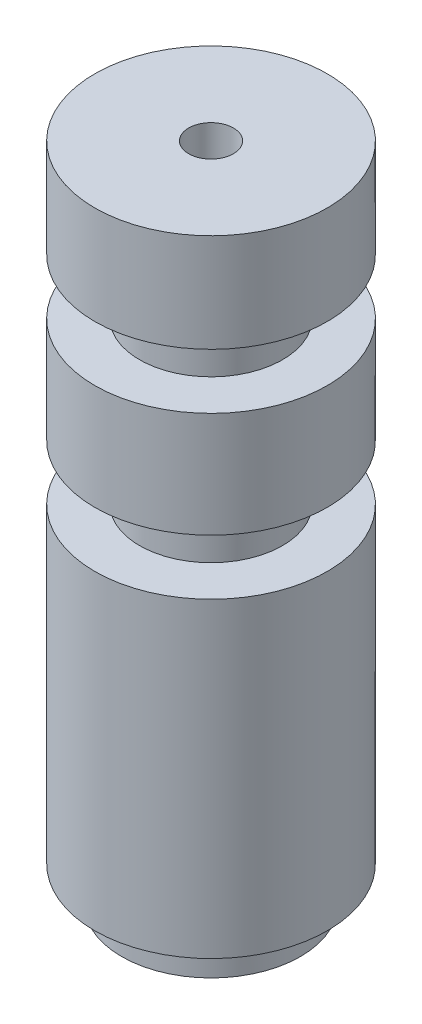
ISO-10303-21;
HEADER;
FILE_DESCRIPTION(('STEP AP214'),'2;1');
FILE_NAME('part.step','',(''),(''),'','','');
FILE_SCHEMA(('AUTOMOTIVE_DESIGN { 1 0 10303 214 1 1 1 1 }'));
ENDSEC;
DATA;
#1=APPLICATION_CONTEXT('core data for automotive mechanical design processes');
#2=APPLICATION_PROTOCOL_DEFINITION('international standard','automotive_design',2000,#1);
#3=PRODUCT_CONTEXT('',#1,'mechanical');
#4=PRODUCT('Part','Part','',(#3));
#5=PRODUCT_RELATED_PRODUCT_CATEGORY('part','',(#4));
#6=PRODUCT_DEFINITION_FORMATION('','',#4);
#7=PRODUCT_DEFINITION_CONTEXT('part definition',#1,'design');
#8=PRODUCT_DEFINITION('design','',#6,#7);
#9=PRODUCT_DEFINITION_SHAPE('','',#8);
#10=(LENGTH_UNIT() NAMED_UNIT(*) SI_UNIT(.MILLI.,.METRE.));
#11=(NAMED_UNIT(*) PLANE_ANGLE_UNIT() SI_UNIT($,.RADIAN.));
#12=(NAMED_UNIT(*) SI_UNIT($,.STERADIAN.) SOLID_ANGLE_UNIT());
#13=UNCERTAINTY_MEASURE_WITH_UNIT(LENGTH_MEASURE(1.E-05),#10,'distance_accuracy_value','');
#14=(GEOMETRIC_REPRESENTATION_CONTEXT(3) GLOBAL_UNCERTAINTY_ASSIGNED_CONTEXT((#13)) GLOBAL_UNIT_ASSIGNED_CONTEXT((#10,
#11,#12)) REPRESENTATION_CONTEXT('',''));
#15=CARTESIAN_POINT('',(0.,0.,0.));
#16=DIRECTION('',(0.,0.,1.));
#17=DIRECTION('',(1.,0.,0.));
#18=AXIS2_PLACEMENT_3D('',#15,#16,#17);
#19=CARTESIAN_POINT('',(0.,0.,0.));
#20=DIRECTION('',(0.,1.,0.));
#21=DIRECTION('',(0.,0.,1.));
#22=AXIS2_PLACEMENT_3D('',#19,#20,#21);
#23=PLANE('',#22);
#24=CARTESIAN_POINT('',(0.,0.,0.));
#25=DIRECTION('',(0.,1.,0.));
#26=DIRECTION('',(0.,0.,1.));
#27=AXIS2_PLACEMENT_3D('',#24,#25,#26);
#28=CIRCLE('',#27,6.5);
#29=CARTESIAN_POINT('',(0.,0.,6.5));
#30=VERTEX_POINT('',#29);
#31=EDGE_CURVE('E47',#30,#30,#28,.T.);
#32=ORIENTED_EDGE('',*,*,#31,.F.);
#33=EDGE_LOOP('',(#32));
#34=FACE_BOUND('',#33,.T.);
#35=CARTESIAN_POINT('',(0.,0.,0.));
#36=DIRECTION('',(0.,1.,0.));
#37=DIRECTION('',(0.,0.,1.));
#38=AXIS2_PLACEMENT_3D('',#35,#36,#37);
#39=CIRCLE('',#38,5.);
#40=CARTESIAN_POINT('',(0.,0.,5.));
#41=VERTEX_POINT('',#40);
#42=EDGE_CURVE('E11',#41,#41,#39,.F.);
#43=ORIENTED_EDGE('',*,*,#42,.F.);
#44=EDGE_LOOP('',(#43));
#45=FACE_BOUND('',#44,.T.);
#46=ADVANCED_FACE('F36',(#34,#45),#23,.F.);
#47=CARTESIAN_POINT('',(0.,35.,0.));
#48=DIRECTION('',(0.,-1.,0.));
#49=DIRECTION('',(0.,0.,-1.));
#50=AXIS2_PLACEMENT_3D('',#47,#48,#49);
#51=CYLINDRICAL_SURFACE('',#50,6.5);
#52=CARTESIAN_POINT('',(0.,20.5,0.));
#53=DIRECTION('',(0.,1.,0.));
#54=DIRECTION('',(0.,0.,1.));
#55=AXIS2_PLACEMENT_3D('',#52,#53,#54);
#56=CIRCLE('',#55,6.5);
#57=CARTESIAN_POINT('',(0.,20.5,6.5));
#58=VERTEX_POINT('',#57);
#59=EDGE_CURVE('E60',#58,#58,#56,.T.);
#60=ORIENTED_EDGE('',*,*,#59,.T.);
#61=EDGE_LOOP('',(#60));
#62=FACE_BOUND('',#61,.T.);
#63=CARTESIAN_POINT('',(0.,26.4,0.));
#64=DIRECTION('',(0.,1.,0.));
#65=DIRECTION('',(0.,0.,1.));
#66=AXIS2_PLACEMENT_3D('',#63,#64,#65);
#67=CIRCLE('',#66,6.5);
#68=CARTESIAN_POINT('',(0.,26.4,6.5));
#69=VERTEX_POINT('',#68);
#70=EDGE_CURVE('E64',#69,#69,#67,.T.);
#71=ORIENTED_EDGE('',*,*,#70,.F.);
#72=EDGE_LOOP('',(#71));
#73=FACE_BOUND('',#72,.T.);
#74=ADVANCED_FACE('F109',(#62,#73),#51,.T.);
#75=ORIENTED_EDGE('',*,*,#31,.T.);
#76=EDGE_LOOP('',(#75));
#77=FACE_BOUND('',#76,.T.);
#78=CARTESIAN_POINT('',(0.,17.4,0.));
#79=DIRECTION('',(0.,1.,0.));
#80=DIRECTION('',(0.,0.,1.));
#81=AXIS2_PLACEMENT_3D('',#78,#79,#80);
#82=CIRCLE('',#81,6.5);
#83=CARTESIAN_POINT('',(0.,17.4,6.5));
#84=VERTEX_POINT('',#83);
#85=EDGE_CURVE('E57',#84,#84,#82,.T.);
#86=ORIENTED_EDGE('',*,*,#85,.F.);
#87=EDGE_LOOP('',(#86));
#88=FACE_BOUND('',#87,.T.);
#89=ADVANCED_FACE('F114',(#77,#88),#51,.T.);
#90=CARTESIAN_POINT('',(0.,29.5,0.));
#91=DIRECTION('',(0.,1.,0.));
#92=DIRECTION('',(0.,0.,1.));
#93=AXIS2_PLACEMENT_3D('',#90,#91,#92);
#94=CIRCLE('',#93,6.5);
#95=CARTESIAN_POINT('',(0.,29.5,6.5));
#96=VERTEX_POINT('',#95);
#97=EDGE_CURVE('E66',#96,#96,#94,.T.);
#98=ORIENTED_EDGE('',*,*,#97,.T.);
#99=EDGE_LOOP('',(#98));
#100=FACE_BOUND('',#99,.T.);
#101=CARTESIAN_POINT('',(0.,35.,0.));
#102=DIRECTION('',(0.,1.,0.));
#103=DIRECTION('',(0.,0.,1.));
#104=AXIS2_PLACEMENT_3D('',#101,#102,#103);
#105=CIRCLE('',#104,6.5);
#106=CARTESIAN_POINT('',(0.,35.,6.5));
#107=VERTEX_POINT('',#106);
#108=EDGE_CURVE('E43',#107,#107,#105,.T.);
#109=ORIENTED_EDGE('',*,*,#108,.F.);
#110=EDGE_LOOP('',(#109));
#111=FACE_BOUND('',#110,.T.);
#112=ADVANCED_FACE('F38',(#100,#111),#51,.T.);
#113=CARTESIAN_POINT('',(0.,35.,0.));
#114=DIRECTION('',(0.,1.,0.));
#115=DIRECTION('',(0.,0.,1.));
#116=AXIS2_PLACEMENT_3D('',#113,#114,#115);
#117=PLANE('',#116);
#118=CARTESIAN_POINT('',(0.,35.,0.));
#119=DIRECTION('',(0.,-1.,0.));
#120=DIRECTION('',(0.,0.,-1.));
#121=AXIS2_PLACEMENT_3D('',#118,#119,#120);
#122=CIRCLE('',#121,1.25);
#123=CARTESIAN_POINT('',(0.,35.,-1.25));
#124=VERTEX_POINT('',#123);
#125=EDGE_CURVE('E52',#124,#124,#122,.T.);
#126=ORIENTED_EDGE('',*,*,#125,.T.);
#127=EDGE_LOOP('',(#126));
#128=FACE_BOUND('',#127,.T.);
#129=ORIENTED_EDGE('',*,*,#108,.T.);
#130=EDGE_LOOP('',(#129));
#131=FACE_BOUND('',#130,.T.);
#132=ADVANCED_FACE('F119',(#128,#131),#117,.T.);
#133=CARTESIAN_POINT('',(0.,35.,0.));
#134=DIRECTION('',(0.,-1.,0.));
#135=DIRECTION('',(0.,0.,-1.));
#136=AXIS2_PLACEMENT_3D('',#133,#134,#135);
#137=CYLINDRICAL_SURFACE('',#136,1.25);
#138=ORIENTED_EDGE('',*,*,#125,.F.);
#139=EDGE_LOOP('',(#138));
#140=FACE_BOUND('',#139,.T.);
#141=CARTESIAN_POINT('',(0.,-2.,0.));
#142=DIRECTION('',(0.,-1.,0.));
#143=DIRECTION('',(0.,0.,-1.));
#144=AXIS2_PLACEMENT_3D('',#141,#142,#143);
#145=CIRCLE('',#144,1.25);
#146=CARTESIAN_POINT('',(0.,-2.,-1.25));
#147=VERTEX_POINT('',#146);
#148=EDGE_CURVE('E86',#147,#147,#145,.T.);
#149=ORIENTED_EDGE('',*,*,#148,.T.);
#150=EDGE_LOOP('',(#149));
#151=FACE_BOUND('',#150,.T.);
#152=ADVANCED_FACE('F90',(#140,#151),#137,.F.);
#153=CARTESIAN_POINT('',(0.,20.5,0.));
#154=DIRECTION('',(0.,1.,0.));
#155=DIRECTION('',(0.,0.,1.));
#156=AXIS2_PLACEMENT_3D('',#153,#154,#155);
#157=PLANE('',#156);
#158=CARTESIAN_POINT('',(0.,20.5,0.));
#159=DIRECTION('',(0.,-1.,0.));
#160=DIRECTION('',(0.,0.,-1.));
#161=AXIS2_PLACEMENT_3D('',#158,#159,#160);
#162=CIRCLE('',#161,4.);
#163=CARTESIAN_POINT('',(0.,20.5,-4.));
#164=VERTEX_POINT('',#163);
#165=EDGE_CURVE('E69',#164,#164,#162,.T.);
#166=ORIENTED_EDGE('',*,*,#165,.F.);
#167=EDGE_LOOP('',(#166));
#168=FACE_BOUND('',#167,.T.);
#169=ORIENTED_EDGE('',*,*,#59,.F.);
#170=EDGE_LOOP('',(#169));
#171=FACE_BOUND('',#170,.T.);
#172=ADVANCED_FACE('F125',(#168,#171),#157,.F.);
#173=CARTESIAN_POINT('',(0.,17.4,0.));
#174=DIRECTION('',(0.,1.,0.));
#175=DIRECTION('',(0.,0.,1.));
#176=AXIS2_PLACEMENT_3D('',#173,#174,#175);
#177=PLANE('',#176);
#178=CARTESIAN_POINT('',(0.,17.4,0.));
#179=DIRECTION('',(0.,-1.,0.));
#180=DIRECTION('',(0.,0.,-1.));
#181=AXIS2_PLACEMENT_3D('',#178,#179,#180);
#182=CIRCLE('',#181,4.);
#183=CARTESIAN_POINT('',(0.,17.4,-4.));
#184=VERTEX_POINT('',#183);
#185=EDGE_CURVE('E61',#184,#184,#182,.T.);
#186=ORIENTED_EDGE('',*,*,#185,.T.);
#187=EDGE_LOOP('',(#186));
#188=FACE_BOUND('',#187,.T.);
#189=ORIENTED_EDGE('',*,*,#85,.T.);
#190=EDGE_LOOP('',(#189));
#191=FACE_BOUND('',#190,.T.);
#192=ADVANCED_FACE('F129',(#188,#191),#177,.T.);
#193=CARTESIAN_POINT('',(0.,20.5,0.));
#194=DIRECTION('',(0.,-1.,0.));
#195=DIRECTION('',(0.,0.,-1.));
#196=AXIS2_PLACEMENT_3D('',#193,#194,#195);
#197=CYLINDRICAL_SURFACE('',#196,4.);
#198=CARTESIAN_POINT('',(0.,20.5,-4.));
#199=CARTESIAN_POINT('',(0.,20.4677083333333,-4.));
#200=CARTESIAN_POINT('',(0.,20.4354166666667,-4.));
#201=CARTESIAN_POINT('',(0.,20.3708333333333,-4.));
#202=CARTESIAN_POINT('',(0.,20.3385416666667,-4.));
#203=CARTESIAN_POINT('',(0.,20.2739583333333,-4.));
#204=CARTESIAN_POINT('',(0.,20.2416666666667,-4.));
#205=CARTESIAN_POINT('',(0.,20.1770833333333,-4.));
#206=CARTESIAN_POINT('',(0.,20.1447916666667,-4.));
#207=CARTESIAN_POINT('',(0.,20.0802083333333,-4.));
#208=CARTESIAN_POINT('',(0.,20.0479166666667,-4.));
#209=CARTESIAN_POINT('',(0.,19.9833333333333,-4.));
#210=CARTESIAN_POINT('',(0.,19.9510416666667,-4.));
#211=CARTESIAN_POINT('',(0.,19.8864583333333,-4.));
#212=CARTESIAN_POINT('',(0.,19.8541666666667,-4.));
#213=CARTESIAN_POINT('',(0.,19.7895833333333,-4.));
#214=CARTESIAN_POINT('',(0.,19.7572916666667,-4.));
#215=CARTESIAN_POINT('',(0.,19.6927083333333,-4.));
#216=CARTESIAN_POINT('',(0.,19.6604166666667,-4.));
#217=CARTESIAN_POINT('',(0.,19.5958333333333,-4.));
#218=CARTESIAN_POINT('',(0.,19.5635416666667,-4.));
#219=CARTESIAN_POINT('',(0.,19.4989583333333,-4.));
#220=CARTESIAN_POINT('',(0.,19.4666666666667,-4.));
#221=CARTESIAN_POINT('',(0.,19.4020833333333,-4.));
#222=CARTESIAN_POINT('',(0.,19.3697916666667,-4.));
#223=CARTESIAN_POINT('',(0.,19.3052083333333,-4.));
#224=CARTESIAN_POINT('',(0.,19.2729166666667,-4.));
#225=CARTESIAN_POINT('',(0.,19.2083333333333,-4.));
#226=CARTESIAN_POINT('',(0.,19.1760416666667,-4.));
#227=CARTESIAN_POINT('',(0.,19.1114583333333,-4.));
#228=CARTESIAN_POINT('',(0.,19.0791666666667,-4.));
#229=CARTESIAN_POINT('',(0.,19.0145833333333,-4.));
#230=CARTESIAN_POINT('',(0.,18.9822916666667,-4.));
#231=CARTESIAN_POINT('',(0.,18.9177083333333,-4.));
#232=CARTESIAN_POINT('',(0.,18.8854166666667,-4.));
#233=CARTESIAN_POINT('',(0.,18.8208333333333,-4.));
#234=CARTESIAN_POINT('',(0.,18.7885416666667,-4.));
#235=CARTESIAN_POINT('',(0.,18.7239583333333,-4.));
#236=CARTESIAN_POINT('',(0.,18.6916666666667,-4.));
#237=CARTESIAN_POINT('',(0.,18.6270833333333,-4.));
#238=CARTESIAN_POINT('',(0.,18.5947916666667,-4.));
#239=CARTESIAN_POINT('',(0.,18.5302083333333,-4.));
#240=CARTESIAN_POINT('',(0.,18.4979166666667,-4.));
#241=CARTESIAN_POINT('',(0.,18.4333333333333,-4.));
#242=CARTESIAN_POINT('',(0.,18.4010416666667,-4.));
#243=CARTESIAN_POINT('',(0.,18.3364583333333,-4.));
#244=CARTESIAN_POINT('',(0.,18.3041666666667,-4.));
#245=CARTESIAN_POINT('',(0.,18.2395833333333,-4.));
#246=CARTESIAN_POINT('',(0.,18.2072916666667,-4.));
#247=CARTESIAN_POINT('',(0.,18.1427083333333,-4.));
#248=CARTESIAN_POINT('',(0.,18.1104166666667,-4.));
#249=CARTESIAN_POINT('',(0.,18.0458333333333,-4.));
#250=CARTESIAN_POINT('',(0.,18.0135416666667,-4.));
#251=CARTESIAN_POINT('',(0.,17.9489583333333,-4.));
#252=CARTESIAN_POINT('',(0.,17.9166666666667,-4.));
#253=CARTESIAN_POINT('',(0.,17.8520833333333,-4.));
#254=CARTESIAN_POINT('',(0.,17.8197916666667,-4.));
#255=CARTESIAN_POINT('',(0.,17.7552083333333,-4.));
#256=CARTESIAN_POINT('',(0.,17.7229166666667,-4.));
#257=CARTESIAN_POINT('',(0.,17.6583333333333,-4.));
#258=CARTESIAN_POINT('',(0.,17.6260416666667,-4.));
#259=CARTESIAN_POINT('',(0.,17.5614583333333,-4.));
#260=CARTESIAN_POINT('',(0.,17.5291666666667,-4.));
#261=CARTESIAN_POINT('',(0.,17.4645833333333,-4.));
#262=CARTESIAN_POINT('',(0.,17.4322916666667,-4.));
#263=CARTESIAN_POINT('',(0.,17.4,-4.));
#264=B_SPLINE_CURVE_WITH_KNOTS('',3,(#198,#199,#200,#201,#202,#203,#204,#205,#206,#207,#208,
#209,#210,#211,#212,#213,#214,#215,#216,#217,#218,#219,#220,#221,#222,#223,#224,#225,#226,#227,
#228,#229,#230,#231,#232,#233,#234,#235,#236,#237,#238,#239,#240,#241,#242,#243,#244,#245,#246,
#247,#248,#249,#250,#251,#252,#253,#254,#255,#256,#257,#258,#259,#260,#261,#262,#263),
.UNSPECIFIED.,.F.,.F.,(4,2,2,2,2,2,2,2,2,2,2,2,2,2,2,2,2,2,2,2,2,2,2,2,2,2,2,2,2,2,2,2,4),(0.,
0.0968750000000032,0.193750000000003,0.290625000000003,0.387500000000002,0.484375000000002,
0.581250000000002,0.678125000000002,0.775000000000001,0.871875000000001,0.968750000000001,
1.065625,1.1625,1.259375,1.35625,1.453125,1.55,1.646875,1.74375,1.840625,1.9375,2.034375,
2.13125,2.228125,2.325,2.421875,2.51875,2.615625,2.7125,2.809375,2.90625,3.003125,3.1),.UNSPECIFIED.);
#265=EDGE_CURVE('BSEAM133',#164,#184,#264,.T.);
#266=ORIENTED_EDGE('',*,*,#165,.T.);
#267=ORIENTED_EDGE('',*,*,#185,.F.);
#268=ORIENTED_EDGE('',*,*,#265,.T.);
#269=ORIENTED_EDGE('',*,*,#265,.F.);
#270=EDGE_LOOP('',(#266,#268,#267,#269));
#271=FACE_BOUND('',#270,.T.);
#272=ADVANCED_FACE('F133',(#271),#197,.T.);
#273=CARTESIAN_POINT('',(0.,29.5,0.));
#274=DIRECTION('',(0.,1.,0.));
#275=DIRECTION('',(0.,0.,1.));
#276=AXIS2_PLACEMENT_3D('',#273,#274,#275);
#277=PLANE('',#276);
#278=CARTESIAN_POINT('',(0.,29.5,0.));
#279=DIRECTION('',(0.,-1.,0.));
#280=DIRECTION('',(0.,0.,-1.));
#281=AXIS2_PLACEMENT_3D('',#278,#279,#280);
#282=CIRCLE('',#281,4.);
#283=CARTESIAN_POINT('',(0.,29.5,-4.));
#284=VERTEX_POINT('',#283);
#285=EDGE_CURVE('E80',#284,#284,#282,.T.);
#286=ORIENTED_EDGE('',*,*,#285,.F.);
#287=EDGE_LOOP('',(#286));
#288=FACE_BOUND('',#287,.T.);
#289=ORIENTED_EDGE('',*,*,#97,.F.);
#290=EDGE_LOOP('',(#289));
#291=FACE_BOUND('',#290,.T.);
#292=ADVANCED_FACE('F137',(#288,#291),#277,.F.);
#293=CARTESIAN_POINT('',(0.,26.4,0.));
#294=DIRECTION('',(0.,1.,0.));
#295=DIRECTION('',(0.,0.,1.));
#296=AXIS2_PLACEMENT_3D('',#293,#294,#295);
#297=PLANE('',#296);
#298=CARTESIAN_POINT('',(0.,26.4,0.));
#299=DIRECTION('',(0.,-1.,0.));
#300=DIRECTION('',(0.,0.,-1.));
#301=AXIS2_PLACEMENT_3D('',#298,#299,#300);
#302=CIRCLE('',#301,4.);
#303=CARTESIAN_POINT('',(0.,26.4,-4.));
#304=VERTEX_POINT('',#303);
#305=EDGE_CURVE('E67',#304,#304,#302,.T.);
#306=ORIENTED_EDGE('',*,*,#305,.T.);
#307=EDGE_LOOP('',(#306));
#308=FACE_BOUND('',#307,.T.);
#309=ORIENTED_EDGE('',*,*,#70,.T.);
#310=EDGE_LOOP('',(#309));
#311=FACE_BOUND('',#310,.T.);
#312=ADVANCED_FACE('F105',(#308,#311),#297,.T.);
#313=CARTESIAN_POINT('',(0.,29.5,0.));
#314=DIRECTION('',(0.,-1.,0.));
#315=DIRECTION('',(0.,0.,-1.));
#316=AXIS2_PLACEMENT_3D('',#313,#314,#315);
#317=CYLINDRICAL_SURFACE('',#316,4.);
#318=CARTESIAN_POINT('',(0.,29.5,-4.));
#319=CARTESIAN_POINT('',(0.,29.4677083333333,-4.));
#320=CARTESIAN_POINT('',(0.,29.4354166666667,-4.));
#321=CARTESIAN_POINT('',(0.,29.3708333333333,-4.));
#322=CARTESIAN_POINT('',(0.,29.3385416666667,-4.));
#323=CARTESIAN_POINT('',(0.,29.2739583333333,-4.));
#324=CARTESIAN_POINT('',(0.,29.2416666666667,-4.));
#325=CARTESIAN_POINT('',(0.,29.1770833333333,-4.));
#326=CARTESIAN_POINT('',(0.,29.1447916666667,-4.));
#327=CARTESIAN_POINT('',(0.,29.0802083333333,-4.));
#328=CARTESIAN_POINT('',(0.,29.0479166666667,-4.));
#329=CARTESIAN_POINT('',(0.,28.9833333333333,-4.));
#330=CARTESIAN_POINT('',(0.,28.9510416666667,-4.));
#331=CARTESIAN_POINT('',(0.,28.8864583333333,-4.));
#332=CARTESIAN_POINT('',(0.,28.8541666666667,-4.));
#333=CARTESIAN_POINT('',(0.,28.7895833333333,-4.));
#334=CARTESIAN_POINT('',(0.,28.7572916666667,-4.));
#335=CARTESIAN_POINT('',(0.,28.6927083333333,-4.));
#336=CARTESIAN_POINT('',(0.,28.6604166666667,-4.));
#337=CARTESIAN_POINT('',(0.,28.5958333333333,-4.));
#338=CARTESIAN_POINT('',(0.,28.5635416666667,-4.));
#339=CARTESIAN_POINT('',(0.,28.4989583333333,-4.));
#340=CARTESIAN_POINT('',(0.,28.4666666666667,-4.));
#341=CARTESIAN_POINT('',(0.,28.4020833333333,-4.));
#342=CARTESIAN_POINT('',(0.,28.3697916666667,-4.));
#343=CARTESIAN_POINT('',(0.,28.3052083333333,-4.));
#344=CARTESIAN_POINT('',(0.,28.2729166666667,-4.));
#345=CARTESIAN_POINT('',(0.,28.2083333333333,-4.));
#346=CARTESIAN_POINT('',(0.,28.1760416666667,-4.));
#347=CARTESIAN_POINT('',(0.,28.1114583333333,-4.));
#348=CARTESIAN_POINT('',(0.,28.0791666666667,-4.));
#349=CARTESIAN_POINT('',(0.,28.0145833333333,-4.));
#350=CARTESIAN_POINT('',(0.,27.9822916666667,-4.));
#351=CARTESIAN_POINT('',(0.,27.9177083333333,-4.));
#352=CARTESIAN_POINT('',(0.,27.8854166666667,-4.));
#353=CARTESIAN_POINT('',(0.,27.8208333333333,-4.));
#354=CARTESIAN_POINT('',(0.,27.7885416666667,-4.));
#355=CARTESIAN_POINT('',(0.,27.7239583333333,-4.));
#356=CARTESIAN_POINT('',(0.,27.6916666666667,-4.));
#357=CARTESIAN_POINT('',(0.,27.6270833333333,-4.));
#358=CARTESIAN_POINT('',(0.,27.5947916666667,-4.));
#359=CARTESIAN_POINT('',(0.,27.5302083333333,-4.));
#360=CARTESIAN_POINT('',(0.,27.4979166666667,-4.));
#361=CARTESIAN_POINT('',(0.,27.4333333333333,-4.));
#362=CARTESIAN_POINT('',(0.,27.4010416666667,-4.));
#363=CARTESIAN_POINT('',(0.,27.3364583333333,-4.));
#364=CARTESIAN_POINT('',(0.,27.3041666666667,-4.));
#365=CARTESIAN_POINT('',(0.,27.2395833333333,-4.));
#366=CARTESIAN_POINT('',(0.,27.2072916666667,-4.));
#367=CARTESIAN_POINT('',(0.,27.1427083333333,-4.));
#368=CARTESIAN_POINT('',(0.,27.1104166666667,-4.));
#369=CARTESIAN_POINT('',(0.,27.0458333333333,-4.));
#370=CARTESIAN_POINT('',(0.,27.0135416666667,-4.));
#371=CARTESIAN_POINT('',(0.,26.9489583333333,-4.));
#372=CARTESIAN_POINT('',(0.,26.9166666666667,-4.));
#373=CARTESIAN_POINT('',(0.,26.8520833333333,-4.));
#374=CARTESIAN_POINT('',(0.,26.8197916666667,-4.));
#375=CARTESIAN_POINT('',(0.,26.7552083333333,-4.));
#376=CARTESIAN_POINT('',(0.,26.7229166666667,-4.));
#377=CARTESIAN_POINT('',(0.,26.6583333333333,-4.));
#378=CARTESIAN_POINT('',(0.,26.6260416666667,-4.));
#379=CARTESIAN_POINT('',(0.,26.5614583333333,-4.));
#380=CARTESIAN_POINT('',(0.,26.5291666666667,-4.));
#381=CARTESIAN_POINT('',(0.,26.4645833333333,-4.));
#382=CARTESIAN_POINT('',(0.,26.4322916666667,-4.));
#383=CARTESIAN_POINT('',(0.,26.4,-4.));
#384=B_SPLINE_CURVE_WITH_KNOTS('',3,(#318,#319,#320,#321,#322,#323,#324,#325,#326,#327,#328,
#329,#330,#331,#332,#333,#334,#335,#336,#337,#338,#339,#340,#341,#342,#343,#344,#345,#346,#347,
#348,#349,#350,#351,#352,#353,#354,#355,#356,#357,#358,#359,#360,#361,#362,#363,#364,#365,#366,
#367,#368,#369,#370,#371,#372,#373,#374,#375,#376,#377,#378,#379,#380,#381,#382,#383),
.UNSPECIFIED.,.F.,.F.,(4,2,2,2,2,2,2,2,2,2,2,2,2,2,2,2,2,2,2,2,2,2,2,2,2,2,2,2,2,2,2,2,4),(0.,
0.0968750000000032,0.193750000000003,0.290625000000003,0.387500000000002,0.484375000000002,
0.581250000000002,0.678125000000002,0.775000000000001,0.871875000000001,0.968750000000001,
1.065625,1.1625,1.259375,1.35625,1.453125,1.55,1.646875,1.74375,1.840625,1.9375,2.034375,
2.13125,2.228125,2.325,2.421875,2.51875,2.615625,2.7125,2.809375,2.90625,3.003125,3.1),.UNSPECIFIED.);
#385=EDGE_CURVE('BSEAM100',#284,#304,#384,.T.);
#386=ORIENTED_EDGE('',*,*,#285,.T.);
#387=ORIENTED_EDGE('',*,*,#305,.F.);
#388=ORIENTED_EDGE('',*,*,#385,.T.);
#389=ORIENTED_EDGE('',*,*,#385,.F.);
#390=EDGE_LOOP('',(#386,#388,#387,#389));
#391=FACE_BOUND('',#390,.T.);
#392=ADVANCED_FACE('F100',(#391),#317,.T.);
#393=CARTESIAN_POINT('',(0.,-2.,0.));
#394=DIRECTION('',(0.,1.,0.));
#395=DIRECTION('',(0.,0.,1.));
#396=AXIS2_PLACEMENT_3D('',#393,#394,#395);
#397=CYLINDRICAL_SURFACE('',#396,5.);
#398=CARTESIAN_POINT('',(0.,-2.,0.));
#399=DIRECTION('',(0.,-1.,0.));
#400=DIRECTION('',(0.,0.,-1.));
#401=AXIS2_PLACEMENT_3D('',#398,#399,#400);
#402=CIRCLE('',#401,5.);
#403=CARTESIAN_POINT('',(0.,-2.,-5.));
#404=VERTEX_POINT('',#403);
#405=EDGE_CURVE('E83',#404,#404,#402,.T.);
#406=ORIENTED_EDGE('',*,*,#405,.F.);
#407=EDGE_LOOP('',(#406));
#408=FACE_BOUND('',#407,.T.);
#409=ORIENTED_EDGE('',*,*,#42,.T.);
#410=EDGE_LOOP('',(#409));
#411=FACE_BOUND('',#410,.T.);
#412=ADVANCED_FACE('F95',(#408,#411),#397,.T.);
#413=CARTESIAN_POINT('',(0.,-2.,0.));
#414=DIRECTION('',(0.,-1.,0.));
#415=DIRECTION('',(0.,0.,-1.));
#416=AXIS2_PLACEMENT_3D('',#413,#414,#415);
#417=PLANE('',#416);
#418=ORIENTED_EDGE('',*,*,#148,.F.);
#419=EDGE_LOOP('',(#418));
#420=FACE_BOUND('',#419,.T.);
#421=ORIENTED_EDGE('',*,*,#405,.T.);
#422=EDGE_LOOP('',(#421));
#423=FACE_BOUND('',#422,.T.);
#424=ADVANCED_FACE('F92',(#420,#423),#417,.T.);
#425=CLOSED_SHELL('',(#46,#74,#89,#112,#132,#152,#172,#192,#272,#292,#312,#392,#412,#424));
#426=MANIFOLD_SOLID_BREP('B2',#425);
#427=ADVANCED_BREP_SHAPE_REPRESENTATION('',(#18,#426),#14);
#428=SHAPE_DEFINITION_REPRESENTATION(#9,#427);
ENDSEC;
END-ISO-10303-21;
